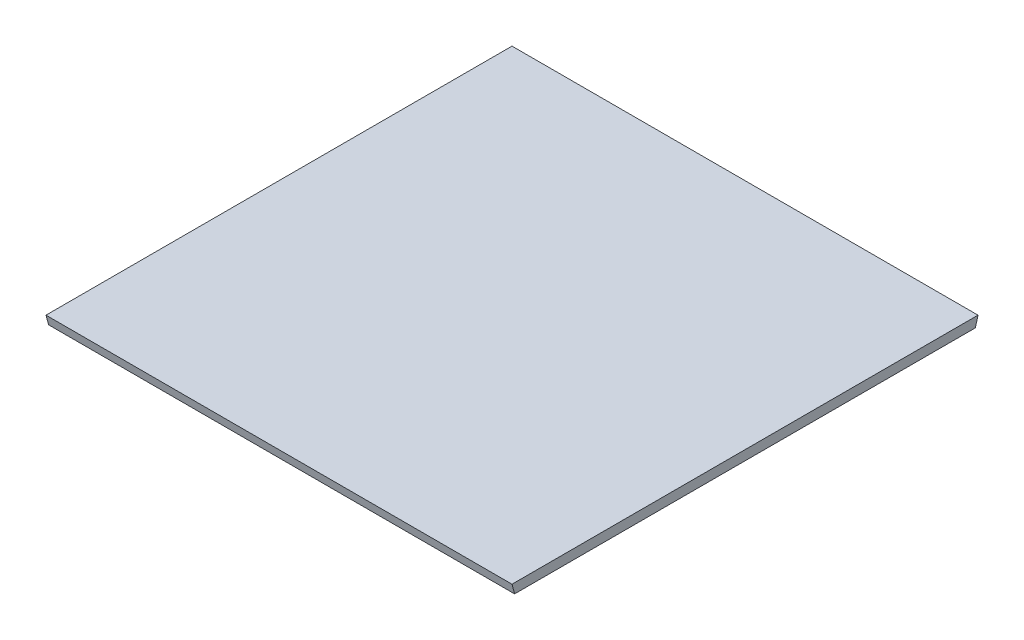
ISO-10303-21;
HEADER;
FILE_DESCRIPTION(('STEP AP214'),'2;1');
FILE_NAME('part.step','',(''),(''),'','','');
FILE_SCHEMA(('AUTOMOTIVE_DESIGN { 1 0 10303 214 1 1 1 1 }'));
ENDSEC;
DATA;
#1=APPLICATION_CONTEXT('core data for automotive mechanical design processes');
#2=APPLICATION_PROTOCOL_DEFINITION('international standard','automotive_design',2000,#1);
#3=PRODUCT_CONTEXT('',#1,'mechanical');
#4=PRODUCT('Part','Part','',(#3));
#5=PRODUCT_RELATED_PRODUCT_CATEGORY('part','',(#4));
#6=PRODUCT_DEFINITION_FORMATION('','',#4);
#7=PRODUCT_DEFINITION_CONTEXT('part definition',#1,'design');
#8=PRODUCT_DEFINITION('design','',#6,#7);
#9=PRODUCT_DEFINITION_SHAPE('','',#8);
#10=(LENGTH_UNIT() NAMED_UNIT(*) SI_UNIT(.MILLI.,.METRE.));
#11=(NAMED_UNIT(*) PLANE_ANGLE_UNIT() SI_UNIT($,.RADIAN.));
#12=(NAMED_UNIT(*) SI_UNIT($,.STERADIAN.) SOLID_ANGLE_UNIT());
#13=UNCERTAINTY_MEASURE_WITH_UNIT(LENGTH_MEASURE(1.E-05),#10,'distance_accuracy_value','');
#14=(GEOMETRIC_REPRESENTATION_CONTEXT(3) GLOBAL_UNCERTAINTY_ASSIGNED_CONTEXT((#13)) GLOBAL_UNIT_ASSIGNED_CONTEXT((#10,
#11,#12)) REPRESENTATION_CONTEXT('',''));
#15=CARTESIAN_POINT('',(0.,0.,0.));
#16=DIRECTION('',(0.,0.,1.));
#17=DIRECTION('',(1.,0.,0.));
#18=AXIS2_PLACEMENT_3D('',#15,#16,#17);
#19=CARTESIAN_POINT('',(609.6,-12.7000000000001,-3.40295474387534));
#20=DIRECTION('',(0.,0.258819045102525,-0.965925826289067));
#21=DIRECTION('',(0.,0.965925826289067,0.258819045102525));
#22=AXIS2_PLACEMENT_3D('',#19,#20,#21);
#23=PLANE('',#22);
#24=DIRECTION('',(0.,-0.965925826289067,-0.258819045102525));
#25=VECTOR('',#24,1.);
#26=CARTESIAN_POINT('',(0.,-12.7000000000001,-3.40295474387534));
#27=LINE('',#26,#25);
#28=CARTESIAN_POINT('',(0.,0.,0.));
#29=VERTEX_POINT('',#28);
#30=CARTESIAN_POINT('',(0.,-12.7000000000001,-3.40295474387534));
#31=VERTEX_POINT('',#30);
#32=EDGE_CURVE('E95',#29,#31,#27,.T.);
#33=ORIENTED_EDGE('',*,*,#32,.T.);
#34=DIRECTION('',(-1.,0.,0.));
#35=VECTOR('',#34,1.);
#36=CARTESIAN_POINT('',(609.6,-12.7000000000001,-3.40295474387534));
#37=LINE('',#36,#35);
#38=CARTESIAN_POINT('',(609.6,-12.7000000000001,-3.40295474387534));
#39=VERTEX_POINT('',#38);
#40=EDGE_CURVE('E11',#39,#31,#37,.T.);
#41=ORIENTED_EDGE('',*,*,#40,.F.);
#42=DIRECTION('',(0.,-0.965925826289067,-0.258819045102525));
#43=VECTOR('',#42,1.);
#44=CARTESIAN_POINT('',(609.6,-12.7000000000001,-3.40295474387534));
#45=LINE('',#44,#43);
#46=CARTESIAN_POINT('',(609.6,0.,0.));
#47=VERTEX_POINT('',#46);
#48=EDGE_CURVE('E83',#47,#39,#45,.T.);
#49=ORIENTED_EDGE('',*,*,#48,.F.);
#50=DIRECTION('',(-1.,0.,0.));
#51=VECTOR('',#50,1.);
#52=CARTESIAN_POINT('',(609.6,0.,0.));
#53=LINE('',#52,#51);
#54=EDGE_CURVE('E91',#47,#29,#53,.T.);
#55=ORIENTED_EDGE('',*,*,#54,.T.);
#56=EDGE_LOOP('',(#33,#41,#49,#55));
#57=FACE_BOUND('',#56,.T.);
#58=ADVANCED_FACE('F32',(#57),#23,.F.);
#59=CARTESIAN_POINT('',(609.6,-12.7,-606.197045256125));
#60=DIRECTION('',(0.,1.,0.));
#61=DIRECTION('',(0.,0.,1.));
#62=AXIS2_PLACEMENT_3D('',#59,#60,#61);
#63=PLANE('',#62);
#64=DIRECTION('',(0.,0.,-1.));
#65=VECTOR('',#64,1.);
#66=CARTESIAN_POINT('',(0.,-12.7,-606.197045256125));
#67=LINE('',#66,#65);
#68=CARTESIAN_POINT('',(0.,-12.7,-606.197045256125));
#69=VERTEX_POINT('',#68);
#70=EDGE_CURVE('E87',#31,#69,#67,.T.);
#71=ORIENTED_EDGE('',*,*,#70,.T.);
#72=DIRECTION('',(-1.,0.,0.));
#73=VECTOR('',#72,1.);
#74=CARTESIAN_POINT('',(609.6,-12.7,-606.197045256125));
#75=LINE('',#74,#73);
#76=CARTESIAN_POINT('',(609.6,-12.7,-606.197045256125));
#77=VERTEX_POINT('',#76);
#78=EDGE_CURVE('E40',#77,#69,#75,.T.);
#79=ORIENTED_EDGE('',*,*,#78,.F.);
#80=DIRECTION('',(0.,0.,-1.));
#81=VECTOR('',#80,1.);
#82=CARTESIAN_POINT('',(609.6,-12.7,-606.197045256125));
#83=LINE('',#82,#81);
#84=EDGE_CURVE('E78',#39,#77,#83,.T.);
#85=ORIENTED_EDGE('',*,*,#84,.F.);
#86=ORIENTED_EDGE('',*,*,#40,.T.);
#87=EDGE_LOOP('',(#71,#79,#85,#86));
#88=FACE_BOUND('',#87,.T.);
#89=ADVANCED_FACE('F86',(#88),#63,.F.);
#90=CARTESIAN_POINT('',(609.6,0.,-609.6));
#91=DIRECTION('',(0.,0.258819045102525,0.965925826289067));
#92=DIRECTION('',(0.,-0.965925826289067,0.258819045102525));
#93=AXIS2_PLACEMENT_3D('',#90,#91,#92);
#94=PLANE('',#93);
#95=DIRECTION('',(0.,0.965925826289067,-0.258819045102525));
#96=VECTOR('',#95,1.);
#97=CARTESIAN_POINT('',(0.,0.,-609.6));
#98=LINE('',#97,#96);
#99=CARTESIAN_POINT('',(0.,0.,-609.6));
#100=VERTEX_POINT('',#99);
#101=EDGE_CURVE('E65',#69,#100,#98,.T.);
#102=ORIENTED_EDGE('',*,*,#101,.T.);
#103=DIRECTION('',(-1.,0.,0.));
#104=VECTOR('',#103,1.);
#105=CARTESIAN_POINT('',(609.6,0.,-609.6));
#106=LINE('',#105,#104);
#107=CARTESIAN_POINT('',(609.6,0.,-609.6));
#108=VERTEX_POINT('',#107);
#109=EDGE_CURVE('E88',#108,#100,#106,.T.);
#110=ORIENTED_EDGE('',*,*,#109,.F.);
#111=DIRECTION('',(0.,0.965925826289067,-0.258819045102525));
#112=VECTOR('',#111,1.);
#113=CARTESIAN_POINT('',(609.6,0.,-609.6));
#114=LINE('',#113,#112);
#115=EDGE_CURVE('E81',#77,#108,#114,.T.);
#116=ORIENTED_EDGE('',*,*,#115,.F.);
#117=ORIENTED_EDGE('',*,*,#78,.T.);
#118=EDGE_LOOP('',(#102,#110,#116,#117));
#119=FACE_BOUND('',#118,.T.);
#120=ADVANCED_FACE('F89',(#119),#94,.F.);
#121=CARTESIAN_POINT('',(609.6,0.,0.));
#122=DIRECTION('',(0.,-1.,0.));
#123=DIRECTION('',(0.,0.,-1.));
#124=AXIS2_PLACEMENT_3D('',#121,#122,#123);
#125=PLANE('',#124);
#126=DIRECTION('',(0.,0.,1.));
#127=VECTOR('',#126,1.);
#128=CARTESIAN_POINT('',(0.,0.,0.));
#129=LINE('',#128,#127);
#130=EDGE_CURVE('E71',#100,#29,#129,.T.);
#131=ORIENTED_EDGE('',*,*,#130,.T.);
#132=ORIENTED_EDGE('',*,*,#54,.F.);
#133=DIRECTION('',(0.,0.,1.));
#134=VECTOR('',#133,1.);
#135=CARTESIAN_POINT('',(609.6,0.,0.));
#136=LINE('',#135,#134);
#137=EDGE_CURVE('E48',#108,#47,#136,.T.);
#138=ORIENTED_EDGE('',*,*,#137,.F.);
#139=ORIENTED_EDGE('',*,*,#109,.T.);
#140=EDGE_LOOP('',(#131,#132,#138,#139));
#141=FACE_BOUND('',#140,.T.);
#142=ADVANCED_FACE('F102',(#141),#125,.F.);
#143=CARTESIAN_POINT('',(609.6,0.,0.));
#144=DIRECTION('',(-1.,0.,0.));
#145=DIRECTION('',(0.,0.,1.));
#146=AXIS2_PLACEMENT_3D('',#143,#144,#145);
#147=PLANE('',#146);
#148=ORIENTED_EDGE('',*,*,#48,.T.);
#149=ORIENTED_EDGE('',*,*,#84,.T.);
#150=ORIENTED_EDGE('',*,*,#115,.T.);
#151=ORIENTED_EDGE('',*,*,#137,.T.);
#152=EDGE_LOOP('',(#148,#149,#150,#151));
#153=FACE_BOUND('',#152,.T.);
#154=ADVANCED_FACE('F79',(#153),#147,.F.);
#155=CARTESIAN_POINT('',(0.,0.,0.));
#156=DIRECTION('',(-1.,0.,0.));
#157=DIRECTION('',(0.,0.,1.));
#158=AXIS2_PLACEMENT_3D('',#155,#156,#157);
#159=PLANE('',#158);
#160=ORIENTED_EDGE('',*,*,#32,.F.);
#161=ORIENTED_EDGE('',*,*,#130,.F.);
#162=ORIENTED_EDGE('',*,*,#101,.F.);
#163=ORIENTED_EDGE('',*,*,#70,.F.);
#164=EDGE_LOOP('',(#160,#161,#162,#163));
#165=FACE_BOUND('',#164,.T.);
#166=ADVANCED_FACE('F105',(#165),#159,.T.);
#167=CLOSED_SHELL('',(#58,#89,#120,#142,#154,#166));
#168=MANIFOLD_SOLID_BREP('B2',#167);
#169=ADVANCED_BREP_SHAPE_REPRESENTATION('',(#18,#168),#14);
#170=SHAPE_DEFINITION_REPRESENTATION(#9,#169);
ENDSEC;
END-ISO-10303-21;
